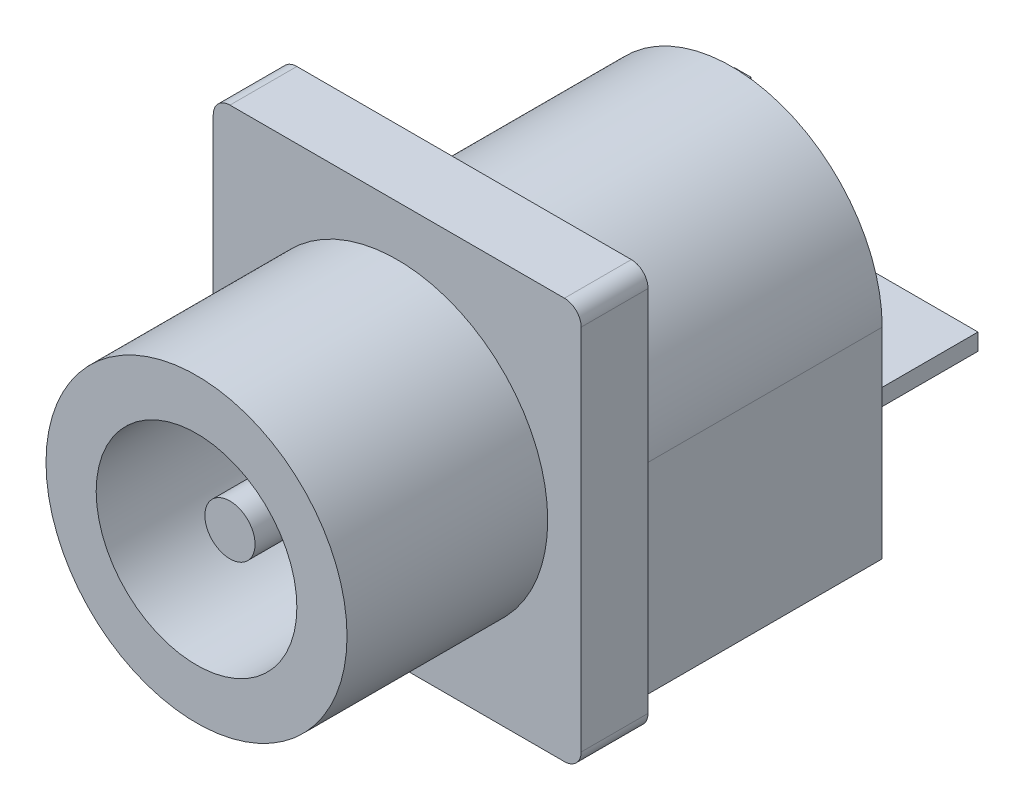
ISO-10303-21;
HEADER;
FILE_DESCRIPTION(('STEP AP214'),'2;1');
FILE_NAME('part.step','',(''),(''),'','','');
FILE_SCHEMA(('AUTOMOTIVE_DESIGN { 1 0 10303 214 1 1 1 1 }'));
ENDSEC;
DATA;
#1=APPLICATION_CONTEXT('core data for automotive mechanical design processes');
#2=APPLICATION_PROTOCOL_DEFINITION('international standard','automotive_design',2000,#1);
#3=PRODUCT_CONTEXT('',#1,'mechanical');
#4=PRODUCT('Part','Part','',(#3));
#5=PRODUCT_RELATED_PRODUCT_CATEGORY('part','',(#4));
#6=PRODUCT_DEFINITION_FORMATION('','',#4);
#7=PRODUCT_DEFINITION_CONTEXT('part definition',#1,'design');
#8=PRODUCT_DEFINITION('design','',#6,#7);
#9=PRODUCT_DEFINITION_SHAPE('','',#8);
#10=(LENGTH_UNIT() NAMED_UNIT(*) SI_UNIT(.MILLI.,.METRE.));
#11=(NAMED_UNIT(*) PLANE_ANGLE_UNIT() SI_UNIT($,.RADIAN.));
#12=(NAMED_UNIT(*) SI_UNIT($,.STERADIAN.) SOLID_ANGLE_UNIT());
#13=UNCERTAINTY_MEASURE_WITH_UNIT(LENGTH_MEASURE(1.E-05),#10,'distance_accuracy_value','');
#14=(GEOMETRIC_REPRESENTATION_CONTEXT(3) GLOBAL_UNCERTAINTY_ASSIGNED_CONTEXT((#13)) GLOBAL_UNIT_ASSIGNED_CONTEXT((#10,
#11,#12)) REPRESENTATION_CONTEXT('',''));
#15=CARTESIAN_POINT('',(0.,0.,0.));
#16=DIRECTION('',(0.,0.,1.));
#17=DIRECTION('',(1.,0.,0.));
#18=AXIS2_PLACEMENT_3D('',#15,#16,#17);
#19=CARTESIAN_POINT('',(5.,-6.,-2.));
#20=DIRECTION('',(0.,1.,0.));
#21=DIRECTION('',(0.,0.,1.));
#22=AXIS2_PLACEMENT_3D('',#19,#20,#21);
#23=PLANE('',#22);
#24=DIRECTION('',(0.,0.,1.));
#25=VECTOR('',#24,1.);
#26=CARTESIAN_POINT('',(3.5,-6.,-10.));
#27=LINE('',#26,#25);
#28=CARTESIAN_POINT('',(3.5,-6.,-10.));
#29=VERTEX_POINT('',#28);
#30=CARTESIAN_POINT('',(3.5,-6.,-6.));
#31=VERTEX_POINT('',#30);
#32=EDGE_CURVE('E246',#29,#31,#27,.T.);
#33=ORIENTED_EDGE('',*,*,#32,.F.);
#34=DIRECTION('',(-1.,0.,0.));
#35=VECTOR('',#34,1.);
#36=CARTESIAN_POINT('',(4.5,-6.,-10.));
#37=LINE('',#36,#35);
#38=CARTESIAN_POINT('',(4.5,-6.,-10.));
#39=VERTEX_POINT('',#38);
#40=EDGE_CURVE('E356',#39,#29,#37,.T.);
#41=ORIENTED_EDGE('',*,*,#40,.F.);
#42=DIRECTION('',(0.,0.,1.));
#43=VECTOR('',#42,1.);
#44=CARTESIAN_POINT('',(4.5,-6.,-10.));
#45=LINE('',#44,#43);
#46=CARTESIAN_POINT('',(4.5,-6.,-2.));
#47=VERTEX_POINT('',#46);
#48=EDGE_CURVE('E374',#39,#47,#45,.T.);
#49=ORIENTED_EDGE('',*,*,#48,.T.);
#50=DIRECTION('',(-1.,0.,0.));
#51=VECTOR('',#50,1.);
#52=CARTESIAN_POINT('',(5.,-6.,-2.));
#53=LINE('',#52,#51);
#54=CARTESIAN_POINT('',(5.,-6.,-2.));
#55=VERTEX_POINT('',#54);
#56=EDGE_CURVE('E398',#55,#47,#53,.T.);
#57=ORIENTED_EDGE('',*,*,#56,.F.);
#58=DIRECTION('',(0.,0.,1.));
#59=VECTOR('',#58,1.);
#60=CARTESIAN_POINT('',(5.,-6.,-2.));
#61=LINE('',#60,#59);
#62=CARTESIAN_POINT('',(5.,-6.,0.));
#63=VERTEX_POINT('',#62);
#64=EDGE_CURVE('E418',#55,#63,#61,.T.);
#65=ORIENTED_EDGE('',*,*,#64,.T.);
#66=DIRECTION('',(-1.,0.,0.));
#67=VECTOR('',#66,1.);
#68=CARTESIAN_POINT('',(5.,-6.,0.));
#69=LINE('',#68,#67);
#70=CARTESIAN_POINT('',(-5.,-6.,0.));
#71=VERTEX_POINT('',#70);
#72=EDGE_CURVE('E385',#63,#71,#69,.T.);
#73=ORIENTED_EDGE('',*,*,#72,.T.);
#74=DIRECTION('',(0.,0.,1.));
#75=VECTOR('',#74,1.);
#76=CARTESIAN_POINT('',(-5.,-6.,-2.));
#77=LINE('',#76,#75);
#78=CARTESIAN_POINT('',(-5.,-6.,-2.));
#79=VERTEX_POINT('',#78);
#80=EDGE_CURVE('E400',#79,#71,#77,.T.);
#81=ORIENTED_EDGE('',*,*,#80,.F.);
#82=CARTESIAN_POINT('',(-4.5,-6.,-2.));
#83=VERTEX_POINT('',#82);
#84=EDGE_CURVE('E397',#83,#79,#53,.T.);
#85=ORIENTED_EDGE('',*,*,#84,.F.);
#86=DIRECTION('',(0.,0.,1.));
#87=VECTOR('',#86,1.);
#88=CARTESIAN_POINT('',(-4.5,-6.,-10.));
#89=LINE('',#88,#87);
#90=CARTESIAN_POINT('',(-4.5,-6.,-10.));
#91=VERTEX_POINT('',#90);
#92=EDGE_CURVE('E371',#91,#83,#89,.T.);
#93=ORIENTED_EDGE('',*,*,#92,.F.);
#94=CARTESIAN_POINT('',(-2.5,-6.,-10.));
#95=VERTEX_POINT('',#94);
#96=EDGE_CURVE('E355',#95,#91,#37,.T.);
#97=ORIENTED_EDGE('',*,*,#96,.F.);
#98=DIRECTION('',(0.,0.,-1.));
#99=VECTOR('',#98,1.);
#100=CARTESIAN_POINT('',(-2.5,-6.,-10.));
#101=LINE('',#100,#99);
#102=CARTESIAN_POINT('',(-2.5,-6.,-6.));
#103=VERTEX_POINT('',#102);
#104=EDGE_CURVE('E242',#103,#95,#101,.T.);
#105=ORIENTED_EDGE('',*,*,#104,.F.);
#106=DIRECTION('',(-1.,0.,0.));
#107=VECTOR('',#106,1.);
#108=CARTESIAN_POINT('',(3.5,-6.,-6.));
#109=LINE('',#108,#107);
#110=EDGE_CURVE('E521',#31,#103,#109,.T.);
#111=ORIENTED_EDGE('',*,*,#110,.F.);
#112=EDGE_LOOP('',(#33,#41,#49,#57,#65,#73,#81,#85,#93,#97,#105,#111));
#113=FACE_BOUND('',#112,.T.);
#114=ADVANCED_FACE('F38',(#113),#23,.F.);
#115=CARTESIAN_POINT('',(0.,0.,-10.));
#116=DIRECTION('',(0.,0.,1.));
#117=DIRECTION('',(1.,0.,0.));
#118=AXIS2_PLACEMENT_3D('',#115,#116,#117);
#119=PLANE('',#118);
#120=DIRECTION('',(0.,1.,0.));
#121=VECTOR('',#120,1.);
#122=CARTESIAN_POINT('',(-4.00203697410621,-5.10866500089655,-10.));
#123=LINE('',#122,#121);
#124=CARTESIAN_POINT('',(-4.00203697410621,-5.60866500089655,-10.));
#125=VERTEX_POINT('',#124);
#126=CARTESIAN_POINT('',(-4.00203697410621,-5.10866500089655,-10.));
#127=VERTEX_POINT('',#126);
#128=EDGE_CURVE('E282',#125,#127,#123,.T.);
#129=ORIENTED_EDGE('',*,*,#128,.F.);
#130=DIRECTION('',(-1.,0.,0.));
#131=VECTOR('',#130,1.);
#132=CARTESIAN_POINT('',(-0.502036974106215,-5.60866500089655,-10.));
#133=LINE('',#132,#131);
#134=CARTESIAN_POINT('',(-0.502036974106215,-5.60866500089655,-10.));
#135=VERTEX_POINT('',#134);
#136=EDGE_CURVE('E287',#135,#125,#133,.T.);
#137=ORIENTED_EDGE('',*,*,#136,.F.);
#138=DIRECTION('',(0.,-1.,0.));
#139=VECTOR('',#138,1.);
#140=CARTESIAN_POINT('',(-0.502036974106215,-5.10866500089655,-10.));
#141=LINE('',#140,#139);
#142=CARTESIAN_POINT('',(-0.502036974106215,-5.10866500089655,-10.));
#143=VERTEX_POINT('',#142);
#144=EDGE_CURVE('E299',#143,#135,#141,.T.);
#145=ORIENTED_EDGE('',*,*,#144,.F.);
#146=DIRECTION('',(1.,0.,0.));
#147=VECTOR('',#146,1.);
#148=CARTESIAN_POINT('',(-0.502036974106215,-5.10866500089655,-10.));
#149=LINE('',#148,#147);
#150=EDGE_CURVE('E296',#127,#143,#149,.T.);
#151=ORIENTED_EDGE('',*,*,#150,.F.);
#152=EDGE_LOOP('',(#129,#137,#145,#151));
#153=FACE_BOUND('',#152,.T.);
#154=CARTESIAN_POINT('',(0.,0.,-10.));
#155=DIRECTION('',(0.,0.,-1.));
#156=DIRECTION('',(1.,0.,0.));
#157=AXIS2_PLACEMENT_3D('',#154,#155,#156);
#158=CIRCLE('',#157,4.5);
#159=CARTESIAN_POINT('',(-4.5,0.,-10.));
#160=VERTEX_POINT('',#159);
#161=CARTESIAN_POINT('',(4.5,0.,-10.));
#162=VERTEX_POINT('',#161);
#163=EDGE_CURVE('E349',#160,#162,#158,.T.);
#164=ORIENTED_EDGE('',*,*,#163,.T.);
#165=DIRECTION('',(0.,-1.,0.));
#166=VECTOR('',#165,1.);
#167=CARTESIAN_POINT('',(4.5,0.,-10.));
#168=LINE('',#167,#166);
#169=EDGE_CURVE('E352',#162,#39,#168,.T.);
#170=ORIENTED_EDGE('',*,*,#169,.T.);
#171=ORIENTED_EDGE('',*,*,#40,.T.);
#172=DIRECTION('',(0.,1.,0.));
#173=VECTOR('',#172,1.);
#174=CARTESIAN_POINT('',(3.5,-7.,-10.));
#175=LINE('',#174,#173);
#176=CARTESIAN_POINT('',(3.5,-7.,-10.));
#177=VERTEX_POINT('',#176);
#178=EDGE_CURVE('E527',#177,#29,#175,.T.);
#179=ORIENTED_EDGE('',*,*,#178,.F.);
#180=DIRECTION('',(1.,0.,0.));
#181=VECTOR('',#180,1.);
#182=CARTESIAN_POINT('',(3.5,-7.,-10.));
#183=LINE('',#182,#181);
#184=CARTESIAN_POINT('',(-2.5,-7.,-10.));
#185=VERTEX_POINT('',#184);
#186=EDGE_CURVE('E239',#185,#177,#183,.T.);
#187=ORIENTED_EDGE('',*,*,#186,.F.);
#188=DIRECTION('',(0.,1.,0.));
#189=VECTOR('',#188,1.);
#190=CARTESIAN_POINT('',(-2.5,-7.,-10.));
#191=LINE('',#190,#189);
#192=EDGE_CURVE('E54',#185,#95,#191,.T.);
#193=ORIENTED_EDGE('',*,*,#192,.T.);
#194=ORIENTED_EDGE('',*,*,#96,.T.);
#195=DIRECTION('',(0.,1.,0.));
#196=VECTOR('',#195,1.);
#197=CARTESIAN_POINT('',(-4.5,-6.,-10.));
#198=LINE('',#197,#196);
#199=EDGE_CURVE('E359',#91,#160,#198,.T.);
#200=ORIENTED_EDGE('',*,*,#199,.T.);
#201=EDGE_LOOP('',(#164,#170,#171,#179,#187,#193,#194,#200));
#202=FACE_BOUND('',#201,.T.);
#203=DIRECTION('',(0.,1.,0.));
#204=VECTOR('',#203,1.);
#205=CARTESIAN_POINT('',(-3.92225141178721,0.511238139903423,-10.));
#206=LINE('',#205,#204);
#207=CARTESIAN_POINT('',(-3.92225141178721,-2.98876186009658,-10.));
#208=VERTEX_POINT('',#207);
#209=CARTESIAN_POINT('',(-3.92225141178721,0.511238139903423,-10.));
#210=VERTEX_POINT('',#209);
#211=EDGE_CURVE('E315',#208,#210,#206,.T.);
#212=ORIENTED_EDGE('',*,*,#211,.F.);
#213=DIRECTION('',(-1.,0.,0.));
#214=VECTOR('',#213,1.);
#215=CARTESIAN_POINT('',(-3.42225141178721,-2.98876186009658,-10.));
#216=LINE('',#215,#214);
#217=CARTESIAN_POINT('',(-3.42225141178721,-2.98876186009658,-10.));
#218=VERTEX_POINT('',#217);
#219=EDGE_CURVE('E320',#218,#208,#216,.T.);
#220=ORIENTED_EDGE('',*,*,#219,.F.);
#221=DIRECTION('',(0.,-1.,0.));
#222=VECTOR('',#221,1.);
#223=CARTESIAN_POINT('',(-3.42225141178721,0.511238139903423,-10.));
#224=LINE('',#223,#222);
#225=CARTESIAN_POINT('',(-3.42225141178721,0.511238139903423,-10.));
#226=VERTEX_POINT('',#225);
#227=EDGE_CURVE('E332',#226,#218,#224,.T.);
#228=ORIENTED_EDGE('',*,*,#227,.F.);
#229=DIRECTION('',(1.,0.,0.));
#230=VECTOR('',#229,1.);
#231=CARTESIAN_POINT('',(-3.42225141178721,0.511238139903423,-10.));
#232=LINE('',#231,#230);
#233=EDGE_CURVE('E329',#210,#226,#232,.T.);
#234=ORIENTED_EDGE('',*,*,#233,.F.);
#235=EDGE_LOOP('',(#212,#220,#228,#234));
#236=FACE_BOUND('',#235,.T.);
#237=DIRECTION('',(0.,1.,0.));
#238=VECTOR('',#237,1.);
#239=CARTESIAN_POINT('',(-0.135758736424911,-2.69310602767297,-10.));
#240=LINE('',#239,#238);
#241=CARTESIAN_POINT('',(-0.135758736424911,-3.19310602767297,-10.));
#242=VERTEX_POINT('',#241);
#243=CARTESIAN_POINT('',(-0.135758736424911,-2.69310602767297,-10.));
#244=VERTEX_POINT('',#243);
#245=EDGE_CURVE('E248',#242,#244,#240,.T.);
#246=ORIENTED_EDGE('',*,*,#245,.F.);
#247=DIRECTION('',(-1.,0.,0.));
#248=VECTOR('',#247,1.);
#249=CARTESIAN_POINT('',(3.36424126357509,-3.19310602767297,-10.));
#250=LINE('',#249,#248);
#251=CARTESIAN_POINT('',(3.36424126357509,-3.19310602767297,-10.));
#252=VERTEX_POINT('',#251);
#253=EDGE_CURVE('E259',#252,#242,#250,.T.);
#254=ORIENTED_EDGE('',*,*,#253,.F.);
#255=DIRECTION('',(0.,-1.,0.));
#256=VECTOR('',#255,1.);
#257=CARTESIAN_POINT('',(3.36424126357509,-2.69310602767297,-10.));
#258=LINE('',#257,#256);
#259=CARTESIAN_POINT('',(3.36424126357509,-2.69310602767297,-10.));
#260=VERTEX_POINT('',#259);
#261=EDGE_CURVE('E267',#260,#252,#258,.T.);
#262=ORIENTED_EDGE('',*,*,#261,.F.);
#263=DIRECTION('',(1.,0.,0.));
#264=VECTOR('',#263,1.);
#265=CARTESIAN_POINT('',(3.36424126357509,-2.69310602767297,-10.));
#266=LINE('',#265,#264);
#267=EDGE_CURVE('E62',#244,#260,#266,.T.);
#268=ORIENTED_EDGE('',*,*,#267,.F.);
#269=EDGE_LOOP('',(#246,#254,#262,#268));
#270=FACE_BOUND('',#269,.T.);
#271=ADVANCED_FACE('F460',(#153,#202,#236,#270),#119,.F.);
#272=CARTESIAN_POINT('',(0.,0.,6.));
#273=DIRECTION('',(0.,0.,-1.));
#274=DIRECTION('',(-1.,0.,0.));
#275=AXIS2_PLACEMENT_3D('',#272,#273,#274);
#276=CYLINDRICAL_SURFACE('',#275,4.5);
#277=CARTESIAN_POINT('',(0.,0.,6.));
#278=DIRECTION('',(0.,0.,1.));
#279=DIRECTION('',(1.,0.,0.));
#280=AXIS2_PLACEMENT_3D('',#277,#278,#279);
#281=CIRCLE('',#280,4.5);
#282=CARTESIAN_POINT('',(4.5,0.,6.));
#283=VERTEX_POINT('',#282);
#284=EDGE_CURVE('E11',#283,#283,#281,.T.);
#285=ORIENTED_EDGE('',*,*,#284,.F.);
#286=EDGE_LOOP('',(#285));
#287=FACE_BOUND('',#286,.T.);
#288=CARTESIAN_POINT('',(0.,0.,0.));
#289=DIRECTION('',(0.,0.,1.));
#290=DIRECTION('',(1.,0.,0.));
#291=AXIS2_PLACEMENT_3D('',#288,#289,#290);
#292=CIRCLE('',#291,4.5);
#293=CARTESIAN_POINT('',(4.5,0.,0.));
#294=VERTEX_POINT('',#293);
#295=EDGE_CURVE('E42',#294,#294,#292,.T.);
#296=ORIENTED_EDGE('',*,*,#295,.T.);
#297=EDGE_LOOP('',(#296));
#298=FACE_BOUND('',#297,.T.);
#299=ADVANCED_FACE('F40',(#287,#298),#276,.T.);
#300=CARTESIAN_POINT('',(0.,0.,6.));
#301=DIRECTION('',(0.,0.,1.));
#302=DIRECTION('',(1.,0.,0.));
#303=AXIS2_PLACEMENT_3D('',#300,#301,#302);
#304=PLANE('',#303);
#305=CARTESIAN_POINT('',(0.,0.,6.));
#306=DIRECTION('',(0.,0.,1.));
#307=DIRECTION('',(1.,0.,0.));
#308=AXIS2_PLACEMENT_3D('',#305,#306,#307);
#309=CIRCLE('',#308,3.);
#310=CARTESIAN_POINT('',(3.,0.,6.));
#311=VERTEX_POINT('',#310);
#312=EDGE_CURVE('E442',#311,#311,#309,.T.);
#313=ORIENTED_EDGE('',*,*,#312,.F.);
#314=EDGE_LOOP('',(#313));
#315=FACE_BOUND('',#314,.T.);
#316=ORIENTED_EDGE('',*,*,#284,.T.);
#317=EDGE_LOOP('',(#316));
#318=FACE_BOUND('',#317,.T.);
#319=ADVANCED_FACE('F453',(#315,#318),#304,.T.);
#320=CARTESIAN_POINT('',(0.,0.,1.));
#321=DIRECTION('',(0.,0.,1.));
#322=DIRECTION('',(1.,0.,0.));
#323=AXIS2_PLACEMENT_3D('',#320,#321,#322);
#324=CYLINDRICAL_SURFACE('',#323,3.);
#325=CARTESIAN_POINT('',(0.,0.,1.));
#326=DIRECTION('',(0.,0.,1.));
#327=DIRECTION('',(1.,0.,0.));
#328=AXIS2_PLACEMENT_3D('',#325,#326,#327);
#329=CIRCLE('',#328,3.);
#330=CARTESIAN_POINT('',(3.,0.,1.));
#331=VERTEX_POINT('',#330);
#332=EDGE_CURVE('E47',#331,#331,#329,.T.);
#333=ORIENTED_EDGE('',*,*,#332,.F.);
#334=EDGE_LOOP('',(#333));
#335=FACE_BOUND('',#334,.T.);
#336=ORIENTED_EDGE('',*,*,#312,.T.);
#337=EDGE_LOOP('',(#336));
#338=FACE_BOUND('',#337,.T.);
#339=ADVANCED_FACE('F451',(#335,#338),#324,.F.);
#340=CARTESIAN_POINT('',(0.,0.,1.));
#341=DIRECTION('',(0.,0.,1.));
#342=DIRECTION('',(1.,0.,0.));
#343=AXIS2_PLACEMENT_3D('',#340,#341,#342);
#344=PLANE('',#343);
#345=CARTESIAN_POINT('',(0.,0.,1.));
#346=DIRECTION('',(0.,0.,1.));
#347=DIRECTION('',(1.,0.,0.));
#348=AXIS2_PLACEMENT_3D('',#345,#346,#347);
#349=CIRCLE('',#348,0.75);
#350=CARTESIAN_POINT('',(0.75,0.,1.));
#351=VERTEX_POINT('',#350);
#352=EDGE_CURVE('E443',#351,#351,#349,.T.);
#353=ORIENTED_EDGE('',*,*,#352,.F.);
#354=EDGE_LOOP('',(#353));
#355=FACE_BOUND('',#354,.T.);
#356=ORIENTED_EDGE('',*,*,#332,.T.);
#357=EDGE_LOOP('',(#356));
#358=FACE_BOUND('',#357,.T.);
#359=ADVANCED_FACE('F573',(#355,#358),#344,.T.);
#360=CARTESIAN_POINT('',(0.,0.,5.));
#361=DIRECTION('',(0.,0.,-1.));
#362=DIRECTION('',(-1.,0.,0.));
#363=AXIS2_PLACEMENT_3D('',#360,#361,#362);
#364=CYLINDRICAL_SURFACE('',#363,0.75);
#365=CARTESIAN_POINT('',(0.,0.,5.));
#366=DIRECTION('',(0.,0.,1.));
#367=DIRECTION('',(1.,0.,0.));
#368=AXIS2_PLACEMENT_3D('',#365,#366,#367);
#369=CIRCLE('',#368,0.75);
#370=CARTESIAN_POINT('',(0.75,0.,5.));
#371=VERTEX_POINT('',#370);
#372=EDGE_CURVE('E439',#371,#371,#369,.T.);
#373=ORIENTED_EDGE('',*,*,#372,.F.);
#374=EDGE_LOOP('',(#373));
#375=FACE_BOUND('',#374,.T.);
#376=ORIENTED_EDGE('',*,*,#352,.T.);
#377=EDGE_LOOP('',(#376));
#378=FACE_BOUND('',#377,.T.);
#379=ADVANCED_FACE('F569',(#375,#378),#364,.T.);
#380=CARTESIAN_POINT('',(0.,0.,5.));
#381=DIRECTION('',(0.,0.,1.));
#382=DIRECTION('',(1.,0.,0.));
#383=AXIS2_PLACEMENT_3D('',#380,#381,#382);
#384=PLANE('',#383);
#385=ORIENTED_EDGE('',*,*,#372,.T.);
#386=EDGE_LOOP('',(#385));
#387=FACE_BOUND('',#386,.T.);
#388=ADVANCED_FACE('F566',(#387),#384,.T.);
#389=CARTESIAN_POINT('',(-5.,-5.5,-2.));
#390=DIRECTION('',(0.,0.,1.));
#391=DIRECTION('',(1.,0.,0.));
#392=AXIS2_PLACEMENT_3D('',#389,#390,#391);
#393=CYLINDRICAL_SURFACE('',#392,0.5);
#394=CARTESIAN_POINT('',(-5.,-5.5,0.));
#395=DIRECTION('',(0.,0.,-1.));
#396=DIRECTION('',(-1.,0.,0.));
#397=AXIS2_PLACEMENT_3D('',#394,#395,#396);
#398=CIRCLE('',#397,0.5);
#399=CARTESIAN_POINT('',(-5.5,-5.5,0.));
#400=VERTEX_POINT('',#399);
#401=EDGE_CURVE('E380',#71,#400,#398,.T.);
#402=ORIENTED_EDGE('',*,*,#401,.T.);
#403=DIRECTION('',(0.,0.,1.));
#404=VECTOR('',#403,1.);
#405=CARTESIAN_POINT('',(-5.5,-5.5,-2.));
#406=LINE('',#405,#404);
#407=CARTESIAN_POINT('',(-5.5,-5.5,-2.));
#408=VERTEX_POINT('',#407);
#409=EDGE_CURVE('E436',#408,#400,#406,.T.);
#410=ORIENTED_EDGE('',*,*,#409,.F.);
#411=CARTESIAN_POINT('',(-5.,-5.5,-2.));
#412=DIRECTION('',(0.,0.,-1.));
#413=DIRECTION('',(-1.,0.,0.));
#414=AXIS2_PLACEMENT_3D('',#411,#412,#413);
#415=CIRCLE('',#414,0.5);
#416=EDGE_CURVE('E381',#79,#408,#415,.T.);
#417=ORIENTED_EDGE('',*,*,#416,.F.);
#418=ORIENTED_EDGE('',*,*,#80,.T.);
#419=EDGE_LOOP('',(#402,#410,#417,#418));
#420=FACE_BOUND('',#419,.T.);
#421=ADVANCED_FACE('F476',(#420),#393,.T.);
#422=CARTESIAN_POINT('',(-5.5,5.5,-2.));
#423=DIRECTION('',(1.,0.,0.));
#424=DIRECTION('',(0.,0.,-1.));
#425=AXIS2_PLACEMENT_3D('',#422,#423,#424);
#426=PLANE('',#425);
#427=DIRECTION('',(0.,1.,0.));
#428=VECTOR('',#427,1.);
#429=CARTESIAN_POINT('',(-5.5,5.5,0.));
#430=LINE('',#429,#428);
#431=CARTESIAN_POINT('',(-5.5,5.5,0.));
#432=VERTEX_POINT('',#431);
#433=EDGE_CURVE('E403',#400,#432,#430,.T.);
#434=ORIENTED_EDGE('',*,*,#433,.T.);
#435=DIRECTION('',(0.,0.,1.));
#436=VECTOR('',#435,1.);
#437=CARTESIAN_POINT('',(-5.5,5.5,-2.));
#438=LINE('',#437,#436);
#439=CARTESIAN_POINT('',(-5.5,5.5,-2.));
#440=VERTEX_POINT('',#439);
#441=EDGE_CURVE('E433',#440,#432,#438,.T.);
#442=ORIENTED_EDGE('',*,*,#441,.F.);
#443=DIRECTION('',(0.,1.,0.));
#444=VECTOR('',#443,1.);
#445=CARTESIAN_POINT('',(-5.5,5.5,-2.));
#446=LINE('',#445,#444);
#447=EDGE_CURVE('E384',#408,#440,#446,.T.);
#448=ORIENTED_EDGE('',*,*,#447,.F.);
#449=ORIENTED_EDGE('',*,*,#409,.T.);
#450=EDGE_LOOP('',(#434,#442,#448,#449));
#451=FACE_BOUND('',#450,.T.);
#452=ADVANCED_FACE('F508',(#451),#426,.F.);
#453=CARTESIAN_POINT('',(-5.,5.5,-2.));
#454=DIRECTION('',(0.,0.,1.));
#455=DIRECTION('',(1.,0.,0.));
#456=AXIS2_PLACEMENT_3D('',#453,#454,#455);
#457=CYLINDRICAL_SURFACE('',#456,0.5);
#458=CARTESIAN_POINT('',(-5.,5.5,0.));
#459=DIRECTION('',(0.,0.,-1.));
#460=DIRECTION('',(1.,0.,0.));
#461=AXIS2_PLACEMENT_3D('',#458,#459,#460);
#462=CIRCLE('',#461,0.5);
#463=CARTESIAN_POINT('',(-5.,6.,0.));
#464=VERTEX_POINT('',#463);
#465=EDGE_CURVE('E405',#432,#464,#462,.T.);
#466=ORIENTED_EDGE('',*,*,#465,.T.);
#467=DIRECTION('',(0.,0.,1.));
#468=VECTOR('',#467,1.);
#469=CARTESIAN_POINT('',(-5.,6.,-2.));
#470=LINE('',#469,#468);
#471=CARTESIAN_POINT('',(-5.,6.,-2.));
#472=VERTEX_POINT('',#471);
#473=EDGE_CURVE('E430',#472,#464,#470,.T.);
#474=ORIENTED_EDGE('',*,*,#473,.F.);
#475=CARTESIAN_POINT('',(-5.,5.5,-2.));
#476=DIRECTION('',(0.,0.,-1.));
#477=DIRECTION('',(1.,0.,0.));
#478=AXIS2_PLACEMENT_3D('',#475,#476,#477);
#479=CIRCLE('',#478,0.5);
#480=EDGE_CURVE('E387',#440,#472,#479,.T.);
#481=ORIENTED_EDGE('',*,*,#480,.F.);
#482=ORIENTED_EDGE('',*,*,#441,.T.);
#483=EDGE_LOOP('',(#466,#474,#481,#482));
#484=FACE_BOUND('',#483,.T.);
#485=ADVANCED_FACE('F504',(#484),#457,.T.);
#486=CARTESIAN_POINT('',(5.,6.,-2.));
#487=DIRECTION('',(0.,-1.,0.));
#488=DIRECTION('',(0.,0.,-1.));
#489=AXIS2_PLACEMENT_3D('',#486,#487,#488);
#490=PLANE('',#489);
#491=DIRECTION('',(1.,0.,0.));
#492=VECTOR('',#491,1.);
#493=CARTESIAN_POINT('',(5.,6.,0.));
#494=LINE('',#493,#492);
#495=CARTESIAN_POINT('',(5.,6.,0.));
#496=VERTEX_POINT('',#495);
#497=EDGE_CURVE('E407',#464,#496,#494,.T.);
#498=ORIENTED_EDGE('',*,*,#497,.T.);
#499=DIRECTION('',(0.,0.,1.));
#500=VECTOR('',#499,1.);
#501=CARTESIAN_POINT('',(5.,6.,-2.));
#502=LINE('',#501,#500);
#503=CARTESIAN_POINT('',(5.,6.,-2.));
#504=VERTEX_POINT('',#503);
#505=EDGE_CURVE('E427',#504,#496,#502,.T.);
#506=ORIENTED_EDGE('',*,*,#505,.F.);
#507=DIRECTION('',(1.,0.,0.));
#508=VECTOR('',#507,1.);
#509=CARTESIAN_POINT('',(5.,6.,-2.));
#510=LINE('',#509,#508);
#511=EDGE_CURVE('E389',#472,#504,#510,.T.);
#512=ORIENTED_EDGE('',*,*,#511,.F.);
#513=ORIENTED_EDGE('',*,*,#473,.T.);
#514=EDGE_LOOP('',(#498,#506,#512,#513));
#515=FACE_BOUND('',#514,.T.);
#516=ADVANCED_FACE('F501',(#515),#490,.F.);
#517=CARTESIAN_POINT('',(5.,5.5,-2.));
#518=DIRECTION('',(0.,0.,1.));
#519=DIRECTION('',(1.,0.,0.));
#520=AXIS2_PLACEMENT_3D('',#517,#518,#519);
#521=CYLINDRICAL_SURFACE('',#520,0.5);
#522=CARTESIAN_POINT('',(5.,5.5,0.));
#523=DIRECTION('',(0.,0.,-1.));
#524=DIRECTION('',(-1.,0.,0.));
#525=AXIS2_PLACEMENT_3D('',#522,#523,#524);
#526=CIRCLE('',#525,0.5);
#527=CARTESIAN_POINT('',(5.5,5.5,0.));
#528=VERTEX_POINT('',#527);
#529=EDGE_CURVE('E409',#496,#528,#526,.T.);
#530=ORIENTED_EDGE('',*,*,#529,.T.);
#531=DIRECTION('',(0.,0.,1.));
#532=VECTOR('',#531,1.);
#533=CARTESIAN_POINT('',(5.5,5.5,-2.));
#534=LINE('',#533,#532);
#535=CARTESIAN_POINT('',(5.5,5.5,-2.));
#536=VERTEX_POINT('',#535);
#537=EDGE_CURVE('E424',#536,#528,#534,.T.);
#538=ORIENTED_EDGE('',*,*,#537,.F.);
#539=CARTESIAN_POINT('',(5.,5.5,-2.));
#540=DIRECTION('',(0.,0.,-1.));
#541=DIRECTION('',(-1.,0.,0.));
#542=AXIS2_PLACEMENT_3D('',#539,#540,#541);
#543=CIRCLE('',#542,0.5);
#544=EDGE_CURVE('E391',#504,#536,#543,.T.);
#545=ORIENTED_EDGE('',*,*,#544,.F.);
#546=ORIENTED_EDGE('',*,*,#505,.T.);
#547=EDGE_LOOP('',(#530,#538,#545,#546));
#548=FACE_BOUND('',#547,.T.);
#549=ADVANCED_FACE('F497',(#548),#521,.T.);
#550=CARTESIAN_POINT('',(5.5,5.5,-2.));
#551=DIRECTION('',(-1.,0.,0.));
#552=DIRECTION('',(0.,0.,1.));
#553=AXIS2_PLACEMENT_3D('',#550,#551,#552);
#554=PLANE('',#553);
#555=DIRECTION('',(0.,-1.,0.));
#556=VECTOR('',#555,1.);
#557=CARTESIAN_POINT('',(5.5,5.5,0.));
#558=LINE('',#557,#556);
#559=CARTESIAN_POINT('',(5.5,-5.5,0.));
#560=VERTEX_POINT('',#559);
#561=EDGE_CURVE('E411',#528,#560,#558,.T.);
#562=ORIENTED_EDGE('',*,*,#561,.T.);
#563=DIRECTION('',(0.,0.,1.));
#564=VECTOR('',#563,1.);
#565=CARTESIAN_POINT('',(5.5,-5.5,-2.));
#566=LINE('',#565,#564);
#567=CARTESIAN_POINT('',(5.5,-5.5,-2.));
#568=VERTEX_POINT('',#567);
#569=EDGE_CURVE('E421',#568,#560,#566,.T.);
#570=ORIENTED_EDGE('',*,*,#569,.F.);
#571=DIRECTION('',(0.,-1.,0.));
#572=VECTOR('',#571,1.);
#573=CARTESIAN_POINT('',(5.5,5.5,-2.));
#574=LINE('',#573,#572);
#575=EDGE_CURVE('E393',#536,#568,#574,.T.);
#576=ORIENTED_EDGE('',*,*,#575,.F.);
#577=ORIENTED_EDGE('',*,*,#537,.T.);
#578=EDGE_LOOP('',(#562,#570,#576,#577));
#579=FACE_BOUND('',#578,.T.);
#580=ADVANCED_FACE('F492',(#579),#554,.F.);
#581=CARTESIAN_POINT('',(5.,-5.5,-2.));
#582=DIRECTION('',(0.,0.,1.));
#583=DIRECTION('',(1.,0.,0.));
#584=AXIS2_PLACEMENT_3D('',#581,#582,#583);
#585=CYLINDRICAL_SURFACE('',#584,0.5);
#586=CARTESIAN_POINT('',(5.,-5.5,0.));
#587=DIRECTION('',(0.,0.,-1.));
#588=DIRECTION('',(-1.,0.,0.));
#589=AXIS2_PLACEMENT_3D('',#586,#587,#588);
#590=CIRCLE('',#589,0.5);
#591=EDGE_CURVE('E413',#560,#63,#590,.T.);
#592=ORIENTED_EDGE('',*,*,#591,.T.);
#593=ORIENTED_EDGE('',*,*,#64,.F.);
#594=CARTESIAN_POINT('',(5.,-5.5,-2.));
#595=DIRECTION('',(0.,0.,-1.));
#596=DIRECTION('',(-1.,0.,0.));
#597=AXIS2_PLACEMENT_3D('',#594,#595,#596);
#598=CIRCLE('',#597,0.5);
#599=EDGE_CURVE('E395',#568,#55,#598,.T.);
#600=ORIENTED_EDGE('',*,*,#599,.F.);
#601=ORIENTED_EDGE('',*,*,#569,.T.);
#602=EDGE_LOOP('',(#592,#593,#600,#601));
#603=FACE_BOUND('',#602,.T.);
#604=ADVANCED_FACE('F486',(#603),#585,.T.);
#605=CARTESIAN_POINT('',(-5.,-5.5,-2.));
#606=DIRECTION('',(0.,0.,-1.));
#607=DIRECTION('',(-1.,0.,0.));
#608=AXIS2_PLACEMENT_3D('',#605,#606,#607);
#609=PLANE('',#608);
#610=DIRECTION('',(0.,1.,0.));
#611=VECTOR('',#610,1.);
#612=CARTESIAN_POINT('',(-4.5,-6.,-2.));
#613=LINE('',#612,#611);
#614=CARTESIAN_POINT('',(-4.5,0.,-2.));
#615=VERTEX_POINT('',#614);
#616=EDGE_CURVE('E353',#83,#615,#613,.T.);
#617=ORIENTED_EDGE('',*,*,#616,.F.);
#618=ORIENTED_EDGE('',*,*,#84,.T.);
#619=ORIENTED_EDGE('',*,*,#416,.T.);
#620=ORIENTED_EDGE('',*,*,#447,.T.);
#621=ORIENTED_EDGE('',*,*,#480,.T.);
#622=ORIENTED_EDGE('',*,*,#511,.T.);
#623=ORIENTED_EDGE('',*,*,#544,.T.);
#624=ORIENTED_EDGE('',*,*,#575,.T.);
#625=ORIENTED_EDGE('',*,*,#599,.T.);
#626=ORIENTED_EDGE('',*,*,#56,.T.);
#627=DIRECTION('',(0.,-1.,0.));
#628=VECTOR('',#627,1.);
#629=CARTESIAN_POINT('',(4.5,0.,-2.));
#630=LINE('',#629,#628);
#631=CARTESIAN_POINT('',(4.5,0.,-2.));
#632=VERTEX_POINT('',#631);
#633=EDGE_CURVE('E364',#632,#47,#630,.T.);
#634=ORIENTED_EDGE('',*,*,#633,.F.);
#635=CARTESIAN_POINT('',(0.,0.,-2.));
#636=DIRECTION('',(0.,0.,-1.));
#637=DIRECTION('',(1.,0.,0.));
#638=AXIS2_PLACEMENT_3D('',#635,#636,#637);
#639=CIRCLE('',#638,4.5);
#640=EDGE_CURVE('E348',#615,#632,#639,.T.);
#641=ORIENTED_EDGE('',*,*,#640,.F.);
#642=EDGE_LOOP('',(#617,#618,#619,#620,#621,#622,#623,#624,#625,#626,#634,#641));
#643=FACE_BOUND('',#642,.T.);
#644=ADVANCED_FACE('F468',(#643),#609,.T.);
#645=CARTESIAN_POINT('',(-5.,-5.5,0.));
#646=DIRECTION('',(0.,0.,-1.));
#647=DIRECTION('',(-1.,0.,0.));
#648=AXIS2_PLACEMENT_3D('',#645,#646,#647);
#649=PLANE('',#648);
#650=ORIENTED_EDGE('',*,*,#295,.F.);
#651=EDGE_LOOP('',(#650));
#652=FACE_BOUND('',#651,.T.);
#653=ORIENTED_EDGE('',*,*,#401,.F.);
#654=ORIENTED_EDGE('',*,*,#72,.F.);
#655=ORIENTED_EDGE('',*,*,#591,.F.);
#656=ORIENTED_EDGE('',*,*,#561,.F.);
#657=ORIENTED_EDGE('',*,*,#529,.F.);
#658=ORIENTED_EDGE('',*,*,#497,.F.);
#659=ORIENTED_EDGE('',*,*,#465,.F.);
#660=ORIENTED_EDGE('',*,*,#433,.F.);
#661=EDGE_LOOP('',(#653,#654,#655,#656,#657,#658,#659,#660));
#662=FACE_BOUND('',#661,.T.);
#663=ADVANCED_FACE('F464',(#652,#662),#649,.F.);
#664=CARTESIAN_POINT('',(0.,0.,-10.));
#665=DIRECTION('',(0.,0.,1.));
#666=DIRECTION('',(1.,0.,0.));
#667=AXIS2_PLACEMENT_3D('',#664,#665,#666);
#668=CYLINDRICAL_SURFACE('',#667,4.5);
#669=ORIENTED_EDGE('',*,*,#640,.T.);
#670=DIRECTION('',(0.,0.,1.));
#671=VECTOR('',#670,1.);
#672=CARTESIAN_POINT('',(4.5,0.,-10.));
#673=LINE('',#672,#671);
#674=EDGE_CURVE('E377',#162,#632,#673,.T.);
#675=ORIENTED_EDGE('',*,*,#674,.F.);
#676=ORIENTED_EDGE('',*,*,#163,.F.);
#677=DIRECTION('',(0.,0.,1.));
#678=VECTOR('',#677,1.);
#679=CARTESIAN_POINT('',(-4.5,0.,-10.));
#680=LINE('',#679,#678);
#681=EDGE_CURVE('E361',#160,#615,#680,.T.);
#682=ORIENTED_EDGE('',*,*,#681,.T.);
#683=EDGE_LOOP('',(#669,#675,#676,#682));
#684=FACE_BOUND('',#683,.T.);
#685=ADVANCED_FACE('F467',(#684),#668,.T.);
#686=CARTESIAN_POINT('',(4.5,0.,-10.));
#687=DIRECTION('',(-1.,0.,0.));
#688=DIRECTION('',(0.,0.,1.));
#689=AXIS2_PLACEMENT_3D('',#686,#687,#688);
#690=PLANE('',#689);
#691=ORIENTED_EDGE('',*,*,#633,.T.);
#692=ORIENTED_EDGE('',*,*,#48,.F.);
#693=ORIENTED_EDGE('',*,*,#169,.F.);
#694=ORIENTED_EDGE('',*,*,#674,.T.);
#695=EDGE_LOOP('',(#691,#692,#693,#694));
#696=FACE_BOUND('',#695,.T.);
#697=ADVANCED_FACE('F533',(#696),#690,.F.);
#698=CARTESIAN_POINT('',(-4.5,-6.,-10.));
#699=DIRECTION('',(1.,0.,0.));
#700=DIRECTION('',(0.,1.,0.));
#701=AXIS2_PLACEMENT_3D('',#698,#699,#700);
#702=PLANE('',#701);
#703=ORIENTED_EDGE('',*,*,#616,.T.);
#704=ORIENTED_EDGE('',*,*,#681,.F.);
#705=ORIENTED_EDGE('',*,*,#199,.F.);
#706=ORIENTED_EDGE('',*,*,#92,.T.);
#707=EDGE_LOOP('',(#703,#704,#705,#706));
#708=FACE_BOUND('',#707,.T.);
#709=ADVANCED_FACE('F512',(#708),#702,.F.);
#710=CARTESIAN_POINT('',(-3.92225141178721,0.511238139903423,-14.));
#711=DIRECTION('',(1.,0.,0.));
#712=DIRECTION('',(0.,0.,-1.));
#713=AXIS2_PLACEMENT_3D('',#710,#711,#712);
#714=PLANE('',#713);
#715=ORIENTED_EDGE('',*,*,#211,.T.);
#716=DIRECTION('',(0.,0.,1.));
#717=VECTOR('',#716,1.);
#718=CARTESIAN_POINT('',(-3.92225141178721,0.511238139903423,-14.));
#719=LINE('',#718,#717);
#720=CARTESIAN_POINT('',(-3.92225141178721,0.511238139903423,-14.));
#721=VERTEX_POINT('',#720);
#722=EDGE_CURVE('E345',#721,#210,#719,.T.);
#723=ORIENTED_EDGE('',*,*,#722,.F.);
#724=DIRECTION('',(0.,1.,0.));
#725=VECTOR('',#724,1.);
#726=CARTESIAN_POINT('',(-3.92225141178721,0.511238139903423,-14.));
#727=LINE('',#726,#725);
#728=CARTESIAN_POINT('',(-3.92225141178721,-2.98876186009658,-14.));
#729=VERTEX_POINT('',#728);
#730=EDGE_CURVE('E316',#729,#721,#727,.T.);
#731=ORIENTED_EDGE('',*,*,#730,.F.);
#732=DIRECTION('',(0.,0.,1.));
#733=VECTOR('',#732,1.);
#734=CARTESIAN_POINT('',(-3.92225141178721,-2.98876186009658,-14.));
#735=LINE('',#734,#733);
#736=EDGE_CURVE('E326',#729,#208,#735,.T.);
#737=ORIENTED_EDGE('',*,*,#736,.T.);
#738=EDGE_LOOP('',(#715,#723,#731,#737));
#739=FACE_BOUND('',#738,.T.);
#740=ADVANCED_FACE('F540',(#739),#714,.F.);
#741=CARTESIAN_POINT('',(-3.42225141178721,0.511238139903423,-14.));
#742=DIRECTION('',(0.,-1.,0.));
#743=DIRECTION('',(1.,0.,0.));
#744=AXIS2_PLACEMENT_3D('',#741,#742,#743);
#745=PLANE('',#744);
#746=ORIENTED_EDGE('',*,*,#233,.T.);
#747=DIRECTION('',(0.,0.,1.));
#748=VECTOR('',#747,1.);
#749=CARTESIAN_POINT('',(-3.42225141178721,0.511238139903423,-14.));
#750=LINE('',#749,#748);
#751=CARTESIAN_POINT('',(-3.42225141178721,0.511238139903423,-14.));
#752=VERTEX_POINT('',#751);
#753=EDGE_CURVE('E342',#752,#226,#750,.T.);
#754=ORIENTED_EDGE('',*,*,#753,.F.);
#755=DIRECTION('',(1.,0.,0.));
#756=VECTOR('',#755,1.);
#757=CARTESIAN_POINT('',(-3.42225141178721,0.511238139903423,-14.));
#758=LINE('',#757,#756);
#759=EDGE_CURVE('E319',#721,#752,#758,.T.);
#760=ORIENTED_EDGE('',*,*,#759,.F.);
#761=ORIENTED_EDGE('',*,*,#722,.T.);
#762=EDGE_LOOP('',(#746,#754,#760,#761));
#763=FACE_BOUND('',#762,.T.);
#764=ADVANCED_FACE('F659',(#763),#745,.F.);
#765=CARTESIAN_POINT('',(-3.42225141178721,0.511238139903423,-14.));
#766=DIRECTION('',(-1.,0.,0.));
#767=DIRECTION('',(0.,0.,1.));
#768=AXIS2_PLACEMENT_3D('',#765,#766,#767);
#769=PLANE('',#768);
#770=ORIENTED_EDGE('',*,*,#227,.T.);
#771=DIRECTION('',(0.,0.,1.));
#772=VECTOR('',#771,1.);
#773=CARTESIAN_POINT('',(-3.42225141178721,-2.98876186009658,-14.));
#774=LINE('',#773,#772);
#775=CARTESIAN_POINT('',(-3.42225141178721,-2.98876186009658,-14.));
#776=VERTEX_POINT('',#775);
#777=EDGE_CURVE('E339',#776,#218,#774,.T.);
#778=ORIENTED_EDGE('',*,*,#777,.F.);
#779=DIRECTION('',(0.,-1.,0.));
#780=VECTOR('',#779,1.);
#781=CARTESIAN_POINT('',(-3.42225141178721,0.511238139903423,-14.));
#782=LINE('',#781,#780);
#783=EDGE_CURVE('E322',#752,#776,#782,.T.);
#784=ORIENTED_EDGE('',*,*,#783,.F.);
#785=ORIENTED_EDGE('',*,*,#753,.T.);
#786=EDGE_LOOP('',(#770,#778,#784,#785));
#787=FACE_BOUND('',#786,.T.);
#788=ADVANCED_FACE('F669',(#787),#769,.F.);
#789=CARTESIAN_POINT('',(-3.42225141178721,-2.98876186009658,-14.));
#790=DIRECTION('',(0.,1.,0.));
#791=DIRECTION('',(-1.,0.,0.));
#792=AXIS2_PLACEMENT_3D('',#789,#790,#791);
#793=PLANE('',#792);
#794=ORIENTED_EDGE('',*,*,#219,.T.);
#795=ORIENTED_EDGE('',*,*,#736,.F.);
#796=DIRECTION('',(-1.,0.,0.));
#797=VECTOR('',#796,1.);
#798=CARTESIAN_POINT('',(-3.42225141178721,-2.98876186009658,-14.));
#799=LINE('',#798,#797);
#800=EDGE_CURVE('E324',#776,#729,#799,.T.);
#801=ORIENTED_EDGE('',*,*,#800,.F.);
#802=ORIENTED_EDGE('',*,*,#777,.T.);
#803=EDGE_LOOP('',(#794,#795,#801,#802));
#804=FACE_BOUND('',#803,.T.);
#805=ADVANCED_FACE('F679',(#804),#793,.F.);
#806=CARTESIAN_POINT('',(0.,0.,-14.));
#807=DIRECTION('',(0.,0.,-1.));
#808=DIRECTION('',(-1.,0.,0.));
#809=AXIS2_PLACEMENT_3D('',#806,#807,#808);
#810=PLANE('',#809);
#811=ORIENTED_EDGE('',*,*,#730,.T.);
#812=ORIENTED_EDGE('',*,*,#759,.T.);
#813=ORIENTED_EDGE('',*,*,#783,.T.);
#814=ORIENTED_EDGE('',*,*,#800,.T.);
#815=EDGE_LOOP('',(#811,#812,#813,#814));
#816=FACE_BOUND('',#815,.T.);
#817=ADVANCED_FACE('F689',(#816),#810,.T.);
#818=CARTESIAN_POINT('',(-4.00203697410621,-5.10866500089655,-14.));
#819=DIRECTION('',(1.,0.,0.));
#820=DIRECTION('',(0.,0.,-1.));
#821=AXIS2_PLACEMENT_3D('',#818,#819,#820);
#822=PLANE('',#821);
#823=ORIENTED_EDGE('',*,*,#128,.T.);
#824=DIRECTION('',(0.,0.,1.));
#825=VECTOR('',#824,1.);
#826=CARTESIAN_POINT('',(-4.00203697410621,-5.10866500089655,-14.));
#827=LINE('',#826,#825);
#828=CARTESIAN_POINT('',(-4.00203697410621,-5.10866500089655,-14.));
#829=VERTEX_POINT('',#828);
#830=EDGE_CURVE('E312',#829,#127,#827,.T.);
#831=ORIENTED_EDGE('',*,*,#830,.F.);
#832=DIRECTION('',(0.,1.,0.));
#833=VECTOR('',#832,1.);
#834=CARTESIAN_POINT('',(-4.00203697410621,-5.10866500089655,-14.));
#835=LINE('',#834,#833);
#836=CARTESIAN_POINT('',(-4.00203697410621,-5.60866500089655,-14.));
#837=VERTEX_POINT('',#836);
#838=EDGE_CURVE('E283',#837,#829,#835,.T.);
#839=ORIENTED_EDGE('',*,*,#838,.F.);
#840=DIRECTION('',(0.,0.,1.));
#841=VECTOR('',#840,1.);
#842=CARTESIAN_POINT('',(-4.00203697410621,-5.60866500089655,-14.));
#843=LINE('',#842,#841);
#844=EDGE_CURVE('E293',#837,#125,#843,.T.);
#845=ORIENTED_EDGE('',*,*,#844,.T.);
#846=EDGE_LOOP('',(#823,#831,#839,#845));
#847=FACE_BOUND('',#846,.T.);
#848=ADVANCED_FACE('F699',(#847),#822,.F.);
#849=CARTESIAN_POINT('',(-0.502036974106215,-5.10866500089655,-14.));
#850=DIRECTION('',(0.,-1.,0.));
#851=DIRECTION('',(0.,0.,-1.));
#852=AXIS2_PLACEMENT_3D('',#849,#850,#851);
#853=PLANE('',#852);
#854=ORIENTED_EDGE('',*,*,#150,.T.);
#855=DIRECTION('',(0.,0.,1.));
#856=VECTOR('',#855,1.);
#857=CARTESIAN_POINT('',(-0.502036974106215,-5.10866500089655,-14.));
#858=LINE('',#857,#856);
#859=CARTESIAN_POINT('',(-0.502036974106215,-5.10866500089655,-14.));
#860=VERTEX_POINT('',#859);
#861=EDGE_CURVE('E309',#860,#143,#858,.T.);
#862=ORIENTED_EDGE('',*,*,#861,.F.);
#863=DIRECTION('',(1.,0.,0.));
#864=VECTOR('',#863,1.);
#865=CARTESIAN_POINT('',(-0.502036974106215,-5.10866500089655,-14.));
#866=LINE('',#865,#864);
#867=EDGE_CURVE('E286',#829,#860,#866,.T.);
#868=ORIENTED_EDGE('',*,*,#867,.F.);
#869=ORIENTED_EDGE('',*,*,#830,.T.);
#870=EDGE_LOOP('',(#854,#862,#868,#869));
#871=FACE_BOUND('',#870,.T.);
#872=ADVANCED_FACE('F709',(#871),#853,.F.);
#873=CARTESIAN_POINT('',(-0.502036974106215,-5.10866500089655,-14.));
#874=DIRECTION('',(-1.,0.,0.));
#875=DIRECTION('',(0.,0.,1.));
#876=AXIS2_PLACEMENT_3D('',#873,#874,#875);
#877=PLANE('',#876);
#878=ORIENTED_EDGE('',*,*,#144,.T.);
#879=DIRECTION('',(0.,0.,1.));
#880=VECTOR('',#879,1.);
#881=CARTESIAN_POINT('',(-0.502036974106215,-5.60866500089655,-14.));
#882=LINE('',#881,#880);
#883=CARTESIAN_POINT('',(-0.502036974106215,-5.60866500089655,-14.));
#884=VERTEX_POINT('',#883);
#885=EDGE_CURVE('E306',#884,#135,#882,.T.);
#886=ORIENTED_EDGE('',*,*,#885,.F.);
#887=DIRECTION('',(0.,-1.,0.));
#888=VECTOR('',#887,1.);
#889=CARTESIAN_POINT('',(-0.502036974106215,-5.10866500089655,-14.));
#890=LINE('',#889,#888);
#891=EDGE_CURVE('E289',#860,#884,#890,.T.);
#892=ORIENTED_EDGE('',*,*,#891,.F.);
#893=ORIENTED_EDGE('',*,*,#861,.T.);
#894=EDGE_LOOP('',(#878,#886,#892,#893));
#895=FACE_BOUND('',#894,.T.);
#896=ADVANCED_FACE('F719',(#895),#877,.F.);
#897=CARTESIAN_POINT('',(-0.502036974106215,-5.60866500089655,-14.));
#898=DIRECTION('',(0.,1.,0.));
#899=DIRECTION('',(0.,0.,1.));
#900=AXIS2_PLACEMENT_3D('',#897,#898,#899);
#901=PLANE('',#900);
#902=ORIENTED_EDGE('',*,*,#136,.T.);
#903=ORIENTED_EDGE('',*,*,#844,.F.);
#904=DIRECTION('',(-1.,0.,0.));
#905=VECTOR('',#904,1.);
#906=CARTESIAN_POINT('',(-0.502036974106215,-5.60866500089655,-14.));
#907=LINE('',#906,#905);
#908=EDGE_CURVE('E291',#884,#837,#907,.T.);
#909=ORIENTED_EDGE('',*,*,#908,.F.);
#910=ORIENTED_EDGE('',*,*,#885,.T.);
#911=EDGE_LOOP('',(#902,#903,#909,#910));
#912=FACE_BOUND('',#911,.T.);
#913=ADVANCED_FACE('F729',(#912),#901,.F.);
#914=CARTESIAN_POINT('',(0.,0.,-14.));
#915=DIRECTION('',(0.,0.,-1.));
#916=DIRECTION('',(-1.,0.,0.));
#917=AXIS2_PLACEMENT_3D('',#914,#915,#916);
#918=PLANE('',#917);
#919=ORIENTED_EDGE('',*,*,#838,.T.);
#920=ORIENTED_EDGE('',*,*,#867,.T.);
#921=ORIENTED_EDGE('',*,*,#891,.T.);
#922=ORIENTED_EDGE('',*,*,#908,.T.);
#923=EDGE_LOOP('',(#919,#920,#921,#922));
#924=FACE_BOUND('',#923,.T.);
#925=ADVANCED_FACE('F739',(#924),#918,.T.);
#926=CARTESIAN_POINT('',(-0.135758736424911,-2.69310602767297,-14.));
#927=DIRECTION('',(1.,0.,0.));
#928=DIRECTION('',(0.,1.,0.));
#929=AXIS2_PLACEMENT_3D('',#926,#927,#928);
#930=PLANE('',#929);
#931=ORIENTED_EDGE('',*,*,#245,.T.);
#932=DIRECTION('',(0.,0.,1.));
#933=VECTOR('',#932,1.);
#934=CARTESIAN_POINT('',(-0.135758736424911,-2.69310602767297,-14.));
#935=LINE('',#934,#933);
#936=CARTESIAN_POINT('',(-0.135758736424911,-2.69310602767297,-14.));
#937=VERTEX_POINT('',#936);
#938=EDGE_CURVE('E280',#937,#244,#935,.T.);
#939=ORIENTED_EDGE('',*,*,#938,.F.);
#940=DIRECTION('',(0.,1.,0.));
#941=VECTOR('',#940,1.);
#942=CARTESIAN_POINT('',(-0.135758736424911,-2.69310602767297,-14.));
#943=LINE('',#942,#941);
#944=CARTESIAN_POINT('',(-0.135758736424911,-3.19310602767297,-14.));
#945=VERTEX_POINT('',#944);
#946=EDGE_CURVE('E255',#945,#937,#943,.T.);
#947=ORIENTED_EDGE('',*,*,#946,.F.);
#948=DIRECTION('',(0.,0.,1.));
#949=VECTOR('',#948,1.);
#950=CARTESIAN_POINT('',(-0.135758736424911,-3.19310602767297,-14.));
#951=LINE('',#950,#949);
#952=EDGE_CURVE('E264',#945,#242,#951,.T.);
#953=ORIENTED_EDGE('',*,*,#952,.T.);
#954=EDGE_LOOP('',(#931,#939,#947,#953));
#955=FACE_BOUND('',#954,.T.);
#956=ADVANCED_FACE('F749',(#955),#930,.F.);
#957=CARTESIAN_POINT('',(3.36424126357509,-2.69310602767297,-14.));
#958=DIRECTION('',(0.,-1.,0.));
#959=DIRECTION('',(0.,0.,-1.));
#960=AXIS2_PLACEMENT_3D('',#957,#958,#959);
#961=PLANE('',#960);
#962=ORIENTED_EDGE('',*,*,#267,.T.);
#963=DIRECTION('',(0.,0.,1.));
#964=VECTOR('',#963,1.);
#965=CARTESIAN_POINT('',(3.36424126357509,-2.69310602767297,-14.));
#966=LINE('',#965,#964);
#967=CARTESIAN_POINT('',(3.36424126357509,-2.69310602767297,-14.));
#968=VERTEX_POINT('',#967);
#969=EDGE_CURVE('E277',#968,#260,#966,.T.);
#970=ORIENTED_EDGE('',*,*,#969,.F.);
#971=DIRECTION('',(1.,0.,0.));
#972=VECTOR('',#971,1.);
#973=CARTESIAN_POINT('',(3.36424126357509,-2.69310602767297,-14.));
#974=LINE('',#973,#972);
#975=EDGE_CURVE('E258',#937,#968,#974,.T.);
#976=ORIENTED_EDGE('',*,*,#975,.F.);
#977=ORIENTED_EDGE('',*,*,#938,.T.);
#978=EDGE_LOOP('',(#962,#970,#976,#977));
#979=FACE_BOUND('',#978,.T.);
#980=ADVANCED_FACE('F759',(#979),#961,.F.);
#981=CARTESIAN_POINT('',(3.36424126357509,-2.69310602767297,-14.));
#982=DIRECTION('',(-1.,0.,0.));
#983=DIRECTION('',(0.,0.,1.));
#984=AXIS2_PLACEMENT_3D('',#981,#982,#983);
#985=PLANE('',#984);
#986=ORIENTED_EDGE('',*,*,#261,.T.);
#987=DIRECTION('',(0.,0.,1.));
#988=VECTOR('',#987,1.);
#989=CARTESIAN_POINT('',(3.36424126357509,-3.19310602767297,-14.));
#990=LINE('',#989,#988);
#991=CARTESIAN_POINT('',(3.36424126357509,-3.19310602767297,-14.));
#992=VERTEX_POINT('',#991);
#993=EDGE_CURVE('E274',#992,#252,#990,.T.);
#994=ORIENTED_EDGE('',*,*,#993,.F.);
#995=DIRECTION('',(0.,-1.,0.));
#996=VECTOR('',#995,1.);
#997=CARTESIAN_POINT('',(3.36424126357509,-2.69310602767297,-14.));
#998=LINE('',#997,#996);
#999=EDGE_CURVE('E261',#968,#992,#998,.T.);
#1000=ORIENTED_EDGE('',*,*,#999,.F.);
#1001=ORIENTED_EDGE('',*,*,#969,.T.);
#1002=EDGE_LOOP('',(#986,#994,#1000,#1001));
#1003=FACE_BOUND('',#1002,.T.);
#1004=ADVANCED_FACE('F769',(#1003),#985,.F.);
#1005=CARTESIAN_POINT('',(3.36424126357509,-3.19310602767297,-14.));
#1006=DIRECTION('',(0.,1.,0.));
#1007=DIRECTION('',(0.,0.,1.));
#1008=AXIS2_PLACEMENT_3D('',#1005,#1006,#1007);
#1009=PLANE('',#1008);
#1010=ORIENTED_EDGE('',*,*,#253,.T.);
#1011=ORIENTED_EDGE('',*,*,#952,.F.);
#1012=DIRECTION('',(-1.,0.,0.));
#1013=VECTOR('',#1012,1.);
#1014=CARTESIAN_POINT('',(3.36424126357509,-3.19310602767297,-14.));
#1015=LINE('',#1014,#1013);
#1016=EDGE_CURVE('E263',#992,#945,#1015,.T.);
#1017=ORIENTED_EDGE('',*,*,#1016,.F.);
#1018=ORIENTED_EDGE('',*,*,#993,.T.);
#1019=EDGE_LOOP('',(#1010,#1011,#1017,#1018));
#1020=FACE_BOUND('',#1019,.T.);
#1021=ADVANCED_FACE('F779',(#1020),#1009,.F.);
#1022=CARTESIAN_POINT('',(0.,0.,-14.));
#1023=DIRECTION('',(0.,0.,-1.));
#1024=DIRECTION('',(-1.,0.,0.));
#1025=AXIS2_PLACEMENT_3D('',#1022,#1023,#1024);
#1026=PLANE('',#1025);
#1027=ORIENTED_EDGE('',*,*,#946,.T.);
#1028=ORIENTED_EDGE('',*,*,#975,.T.);
#1029=ORIENTED_EDGE('',*,*,#999,.T.);
#1030=ORIENTED_EDGE('',*,*,#1016,.T.);
#1031=EDGE_LOOP('',(#1027,#1028,#1029,#1030));
#1032=FACE_BOUND('',#1031,.T.);
#1033=ADVANCED_FACE('F789',(#1032),#1026,.T.);
#1034=CARTESIAN_POINT('',(3.5,-7.,-10.));
#1035=DIRECTION('',(-1.,0.,0.));
#1036=DIRECTION('',(0.,0.,1.));
#1037=AXIS2_PLACEMENT_3D('',#1034,#1035,#1036);
#1038=PLANE('',#1037);
#1039=ORIENTED_EDGE('',*,*,#32,.T.);
#1040=DIRECTION('',(0.,1.,0.));
#1041=VECTOR('',#1040,1.);
#1042=CARTESIAN_POINT('',(3.5,-7.,-6.));
#1043=LINE('',#1042,#1041);
#1044=CARTESIAN_POINT('',(3.5,-7.,-6.));
#1045=VERTEX_POINT('',#1044);
#1046=EDGE_CURVE('E228',#1045,#31,#1043,.T.);
#1047=ORIENTED_EDGE('',*,*,#1046,.F.);
#1048=DIRECTION('',(0.,0.,1.));
#1049=VECTOR('',#1048,1.);
#1050=CARTESIAN_POINT('',(3.5,-7.,-10.));
#1051=LINE('',#1050,#1049);
#1052=EDGE_CURVE('E235',#177,#1045,#1051,.T.);
#1053=ORIENTED_EDGE('',*,*,#1052,.F.);
#1054=ORIENTED_EDGE('',*,*,#178,.T.);
#1055=EDGE_LOOP('',(#1039,#1047,#1053,#1054));
#1056=FACE_BOUND('',#1055,.T.);
#1057=ADVANCED_FACE('F244',(#1056),#1038,.F.);
#1058=CARTESIAN_POINT('',(3.5,-7.,-6.));
#1059=DIRECTION('',(0.,0.,-1.));
#1060=DIRECTION('',(-1.,0.,0.));
#1061=AXIS2_PLACEMENT_3D('',#1058,#1059,#1060);
#1062=PLANE('',#1061);
#1063=ORIENTED_EDGE('',*,*,#110,.T.);
#1064=DIRECTION('',(0.,1.,0.));
#1065=VECTOR('',#1064,1.);
#1066=CARTESIAN_POINT('',(-2.5,-7.,-6.));
#1067=LINE('',#1066,#1065);
#1068=CARTESIAN_POINT('',(-2.5,-7.,-6.));
#1069=VERTEX_POINT('',#1068);
#1070=EDGE_CURVE('E231',#1069,#103,#1067,.T.);
#1071=ORIENTED_EDGE('',*,*,#1070,.F.);
#1072=DIRECTION('',(-1.,0.,0.));
#1073=VECTOR('',#1072,1.);
#1074=CARTESIAN_POINT('',(3.5,-7.,-6.));
#1075=LINE('',#1074,#1073);
#1076=EDGE_CURVE('E224',#1045,#1069,#1075,.T.);
#1077=ORIENTED_EDGE('',*,*,#1076,.F.);
#1078=ORIENTED_EDGE('',*,*,#1046,.T.);
#1079=EDGE_LOOP('',(#1063,#1071,#1077,#1078));
#1080=FACE_BOUND('',#1079,.T.);
#1081=ADVANCED_FACE('F226',(#1080),#1062,.F.);
#1082=CARTESIAN_POINT('',(-2.5,-7.,-10.));
#1083=DIRECTION('',(1.,0.,0.));
#1084=DIRECTION('',(0.,0.,-1.));
#1085=AXIS2_PLACEMENT_3D('',#1082,#1083,#1084);
#1086=PLANE('',#1085);
#1087=ORIENTED_EDGE('',*,*,#104,.T.);
#1088=ORIENTED_EDGE('',*,*,#192,.F.);
#1089=DIRECTION('',(0.,0.,-1.));
#1090=VECTOR('',#1089,1.);
#1091=CARTESIAN_POINT('',(-2.5,-7.,-10.));
#1092=LINE('',#1091,#1090);
#1093=EDGE_CURVE('E234',#1069,#185,#1092,.T.);
#1094=ORIENTED_EDGE('',*,*,#1093,.F.);
#1095=ORIENTED_EDGE('',*,*,#1070,.T.);
#1096=EDGE_LOOP('',(#1087,#1088,#1094,#1095));
#1097=FACE_BOUND('',#1096,.T.);
#1098=ADVANCED_FACE('F530',(#1097),#1086,.F.);
#1099=CARTESIAN_POINT('',(0.,-7.,0.));
#1100=DIRECTION('',(0.,-1.,0.));
#1101=DIRECTION('',(0.,0.,-1.));
#1102=AXIS2_PLACEMENT_3D('',#1099,#1100,#1101);
#1103=PLANE('',#1102);
#1104=ORIENTED_EDGE('',*,*,#1052,.T.);
#1105=ORIENTED_EDGE('',*,*,#1076,.T.);
#1106=ORIENTED_EDGE('',*,*,#1093,.T.);
#1107=ORIENTED_EDGE('',*,*,#186,.T.);
#1108=EDGE_LOOP('',(#1104,#1105,#1106,#1107));
#1109=FACE_BOUND('',#1108,.T.);
#1110=ADVANCED_FACE('F238',(#1109),#1103,.T.);
#1111=CLOSED_SHELL('',(#114,#271,#299,#319,#339,#359,#379,#388,#421,#452,#485,#516,#549,#580,
#604,#644,#663,#685,#697,#709,#740,#764,#788,#805,#817,#848,#872,#896,#913,#925,#956,#980,#1004,
#1021,#1033,#1057,#1081,#1098,#1110));
#1112=MANIFOLD_SOLID_BREP('B2',#1111);
#1113=ADVANCED_BREP_SHAPE_REPRESENTATION('',(#18,#1112),#14);
#1114=SHAPE_DEFINITION_REPRESENTATION(#9,#1113);
ENDSEC;
END-ISO-10303-21;
